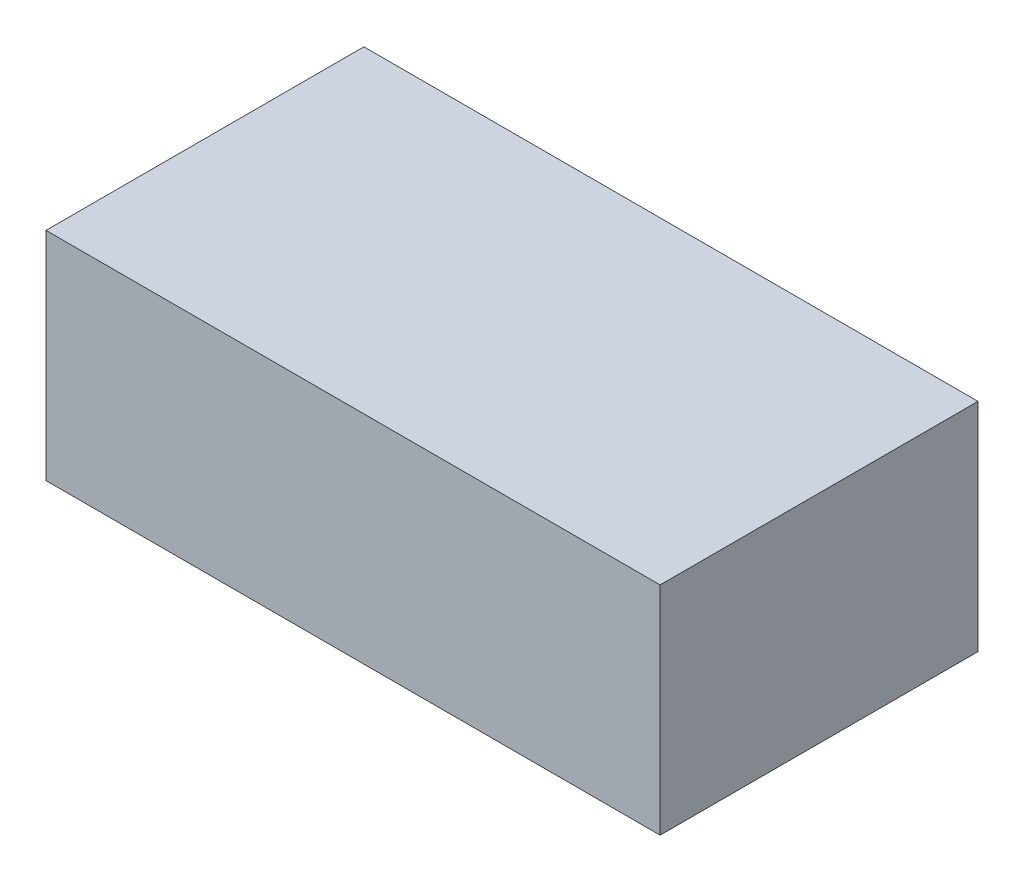
ISO-10303-21;
HEADER;
FILE_DESCRIPTION(('STEP AP214'),'2;1');
FILE_NAME('part.step','',(''),(''),'','','');
FILE_SCHEMA(('AUTOMOTIVE_DESIGN { 1 0 10303 214 1 1 1 1 }'));
ENDSEC;
DATA;
#1=APPLICATION_CONTEXT('core data for automotive mechanical design processes');
#2=APPLICATION_PROTOCOL_DEFINITION('international standard','automotive_design',2000,#1);
#3=PRODUCT_CONTEXT('',#1,'mechanical');
#4=PRODUCT('Part','Part','',(#3));
#5=PRODUCT_RELATED_PRODUCT_CATEGORY('part','',(#4));
#6=PRODUCT_DEFINITION_FORMATION('','',#4);
#7=PRODUCT_DEFINITION_CONTEXT('part definition',#1,'design');
#8=PRODUCT_DEFINITION('design','',#6,#7);
#9=PRODUCT_DEFINITION_SHAPE('','',#8);
#10=(LENGTH_UNIT() NAMED_UNIT(*) SI_UNIT(.MILLI.,.METRE.));
#11=(NAMED_UNIT(*) PLANE_ANGLE_UNIT() SI_UNIT($,.RADIAN.));
#12=(NAMED_UNIT(*) SI_UNIT($,.STERADIAN.) SOLID_ANGLE_UNIT());
#13=UNCERTAINTY_MEASURE_WITH_UNIT(LENGTH_MEASURE(1.E-05),#10,'distance_accuracy_value','');
#14=(GEOMETRIC_REPRESENTATION_CONTEXT(3) GLOBAL_UNCERTAINTY_ASSIGNED_CONTEXT((#13)) GLOBAL_UNIT_ASSIGNED_CONTEXT((#10,
#11,#12)) REPRESENTATION_CONTEXT('',''));
#15=CARTESIAN_POINT('',(0.,0.,0.));
#16=DIRECTION('',(0.,0.,1.));
#17=DIRECTION('',(1.,0.,0.));
#18=AXIS2_PLACEMENT_3D('',#15,#16,#17);
#19=CARTESIAN_POINT('',(0.,30.,0.));
#20=DIRECTION('',(1.,0.,0.));
#21=DIRECTION('',(0.,0.,-1.));
#22=AXIS2_PLACEMENT_3D('',#19,#20,#21);
#23=PLANE('',#22);
#24=DIRECTION('',(0.,0.,1.));
#25=VECTOR('',#24,1.);
#26=CARTESIAN_POINT('',(0.,0.,0.));
#27=LINE('',#26,#25);
#28=CARTESIAN_POINT('',(0.,0.,-44.));
#29=VERTEX_POINT('',#28);
#30=CARTESIAN_POINT('',(0.,0.,0.));
#31=VERTEX_POINT('',#30);
#32=EDGE_CURVE('E100',#29,#31,#27,.T.);
#33=ORIENTED_EDGE('',*,*,#32,.T.);
#34=DIRECTION('',(0.,-1.,0.));
#35=VECTOR('',#34,1.);
#36=CARTESIAN_POINT('',(0.,30.,0.));
#37=LINE('',#36,#35);
#38=CARTESIAN_POINT('',(0.,30.,0.));
#39=VERTEX_POINT('',#38);
#40=EDGE_CURVE('E11',#39,#31,#37,.T.);
#41=ORIENTED_EDGE('',*,*,#40,.F.);
#42=DIRECTION('',(0.,0.,1.));
#43=VECTOR('',#42,1.);
#44=CARTESIAN_POINT('',(0.,30.,0.));
#45=LINE('',#44,#43);
#46=CARTESIAN_POINT('',(0.,30.,-44.));
#47=VERTEX_POINT('',#46);
#48=EDGE_CURVE('E88',#47,#39,#45,.T.);
#49=ORIENTED_EDGE('',*,*,#48,.F.);
#50=DIRECTION('',(0.,-1.,0.));
#51=VECTOR('',#50,1.);
#52=CARTESIAN_POINT('',(0.,30.,-44.));
#53=LINE('',#52,#51);
#54=EDGE_CURVE('E96',#47,#29,#53,.T.);
#55=ORIENTED_EDGE('',*,*,#54,.T.);
#56=EDGE_LOOP('',(#33,#41,#49,#55));
#57=FACE_BOUND('',#56,.T.);
#58=ADVANCED_FACE('F37',(#57),#23,.F.);
#59=CARTESIAN_POINT('',(0.,30.,0.));
#60=DIRECTION('',(0.,0.,-1.));
#61=DIRECTION('',(-1.,0.,0.));
#62=AXIS2_PLACEMENT_3D('',#59,#60,#61);
#63=PLANE('',#62);
#64=DIRECTION('',(1.,0.,0.));
#65=VECTOR('',#64,1.);
#66=CARTESIAN_POINT('',(0.,0.,0.));
#67=LINE('',#66,#65);
#68=CARTESIAN_POINT('',(85.,0.,0.));
#69=VERTEX_POINT('',#68);
#70=EDGE_CURVE('E92',#31,#69,#67,.T.);
#71=ORIENTED_EDGE('',*,*,#70,.T.);
#72=DIRECTION('',(0.,-1.,0.));
#73=VECTOR('',#72,1.);
#74=CARTESIAN_POINT('',(85.,30.,0.));
#75=LINE('',#74,#73);
#76=CARTESIAN_POINT('',(85.,30.,0.));
#77=VERTEX_POINT('',#76);
#78=EDGE_CURVE('E45',#77,#69,#75,.T.);
#79=ORIENTED_EDGE('',*,*,#78,.F.);
#80=DIRECTION('',(1.,0.,0.));
#81=VECTOR('',#80,1.);
#82=CARTESIAN_POINT('',(0.,30.,0.));
#83=LINE('',#82,#81);
#84=EDGE_CURVE('E83',#39,#77,#83,.T.);
#85=ORIENTED_EDGE('',*,*,#84,.F.);
#86=ORIENTED_EDGE('',*,*,#40,.T.);
#87=EDGE_LOOP('',(#71,#79,#85,#86));
#88=FACE_BOUND('',#87,.T.);
#89=ADVANCED_FACE('F91',(#88),#63,.F.);
#90=CARTESIAN_POINT('',(85.,30.,0.));
#91=DIRECTION('',(-1.,0.,0.));
#92=DIRECTION('',(0.,0.,1.));
#93=AXIS2_PLACEMENT_3D('',#90,#91,#92);
#94=PLANE('',#93);
#95=DIRECTION('',(0.,0.,-1.));
#96=VECTOR('',#95,1.);
#97=CARTESIAN_POINT('',(85.,0.,0.));
#98=LINE('',#97,#96);
#99=CARTESIAN_POINT('',(85.,0.,-44.));
#100=VERTEX_POINT('',#99);
#101=EDGE_CURVE('E70',#69,#100,#98,.T.);
#102=ORIENTED_EDGE('',*,*,#101,.T.);
#103=DIRECTION('',(0.,-1.,0.));
#104=VECTOR('',#103,1.);
#105=CARTESIAN_POINT('',(85.,30.,-44.));
#106=LINE('',#105,#104);
#107=CARTESIAN_POINT('',(85.,30.,-44.));
#108=VERTEX_POINT('',#107);
#109=EDGE_CURVE('E93',#108,#100,#106,.T.);
#110=ORIENTED_EDGE('',*,*,#109,.F.);
#111=DIRECTION('',(0.,0.,-1.));
#112=VECTOR('',#111,1.);
#113=CARTESIAN_POINT('',(85.,30.,0.));
#114=LINE('',#113,#112);
#115=EDGE_CURVE('E86',#77,#108,#114,.T.);
#116=ORIENTED_EDGE('',*,*,#115,.F.);
#117=ORIENTED_EDGE('',*,*,#78,.T.);
#118=EDGE_LOOP('',(#102,#110,#116,#117));
#119=FACE_BOUND('',#118,.T.);
#120=ADVANCED_FACE('F94',(#119),#94,.F.);
#121=CARTESIAN_POINT('',(0.,30.,-44.));
#122=DIRECTION('',(0.,0.,1.));
#123=DIRECTION('',(1.,0.,0.));
#124=AXIS2_PLACEMENT_3D('',#121,#122,#123);
#125=PLANE('',#124);
#126=DIRECTION('',(-1.,0.,0.));
#127=VECTOR('',#126,1.);
#128=CARTESIAN_POINT('',(0.,0.,-44.));
#129=LINE('',#128,#127);
#130=EDGE_CURVE('E76',#100,#29,#129,.T.);
#131=ORIENTED_EDGE('',*,*,#130,.T.);
#132=ORIENTED_EDGE('',*,*,#54,.F.);
#133=DIRECTION('',(-1.,0.,0.));
#134=VECTOR('',#133,1.);
#135=CARTESIAN_POINT('',(0.,30.,-44.));
#136=LINE('',#135,#134);
#137=EDGE_CURVE('E53',#108,#47,#136,.T.);
#138=ORIENTED_EDGE('',*,*,#137,.F.);
#139=ORIENTED_EDGE('',*,*,#109,.T.);
#140=EDGE_LOOP('',(#131,#132,#138,#139));
#141=FACE_BOUND('',#140,.T.);
#142=ADVANCED_FACE('F107',(#141),#125,.F.);
#143=CARTESIAN_POINT('',(0.,30.,0.));
#144=DIRECTION('',(0.,-1.,0.));
#145=DIRECTION('',(0.,0.,-1.));
#146=AXIS2_PLACEMENT_3D('',#143,#144,#145);
#147=PLANE('',#146);
#148=ORIENTED_EDGE('',*,*,#48,.T.);
#149=ORIENTED_EDGE('',*,*,#84,.T.);
#150=ORIENTED_EDGE('',*,*,#115,.T.);
#151=ORIENTED_EDGE('',*,*,#137,.T.);
#152=EDGE_LOOP('',(#148,#149,#150,#151));
#153=FACE_BOUND('',#152,.T.);
#154=ADVANCED_FACE('F84',(#153),#147,.F.);
#155=CARTESIAN_POINT('',(0.,0.,0.));
#156=DIRECTION('',(0.,-1.,0.));
#157=DIRECTION('',(0.,0.,-1.));
#158=AXIS2_PLACEMENT_3D('',#155,#156,#157);
#159=PLANE('',#158);
#160=ORIENTED_EDGE('',*,*,#32,.F.);
#161=ORIENTED_EDGE('',*,*,#130,.F.);
#162=ORIENTED_EDGE('',*,*,#101,.F.);
#163=ORIENTED_EDGE('',*,*,#70,.F.);
#164=EDGE_LOOP('',(#160,#161,#162,#163));
#165=FACE_BOUND('',#164,.T.);
#166=ADVANCED_FACE('F110',(#165),#159,.T.);
#167=CLOSED_SHELL('',(#58,#89,#120,#142,#154,#166));
#168=MANIFOLD_SOLID_BREP('B2',#167);
#169=ADVANCED_BREP_SHAPE_REPRESENTATION('',(#18,#168),#14);
#170=SHAPE_DEFINITION_REPRESENTATION(#9,#169);
ENDSEC;
END-ISO-10303-21;
